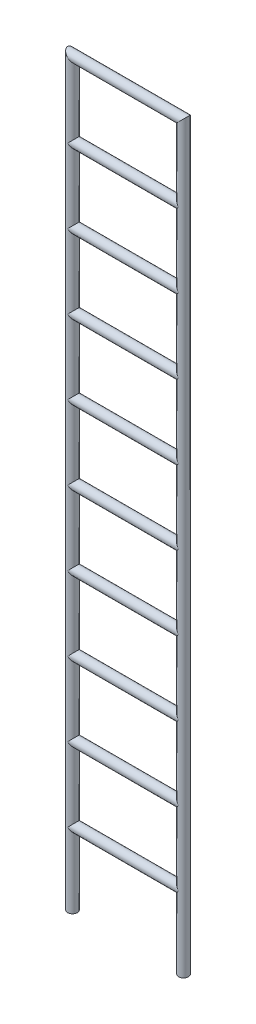
ISO-10303-21;
HEADER;
FILE_DESCRIPTION(('STEP AP214'),'2;1');
FILE_NAME('part.step','',(''),(''),'','','');
FILE_SCHEMA(('AUTOMOTIVE_DESIGN { 1 0 10303 214 1 1 1 1 }'));
ENDSEC;
DATA;
#1=APPLICATION_CONTEXT('core data for automotive mechanical design processes');
#2=APPLICATION_PROTOCOL_DEFINITION('international standard','automotive_design',2000,#1);
#3=PRODUCT_CONTEXT('',#1,'mechanical');
#4=PRODUCT('Part','Part','',(#3));
#5=PRODUCT_RELATED_PRODUCT_CATEGORY('part','',(#4));
#6=PRODUCT_DEFINITION_FORMATION('','',#4);
#7=PRODUCT_DEFINITION_CONTEXT('part definition',#1,'design');
#8=PRODUCT_DEFINITION('design','',#6,#7);
#9=PRODUCT_DEFINITION_SHAPE('','',#8);
#10=(LENGTH_UNIT() NAMED_UNIT(*) SI_UNIT(.MILLI.,.METRE.));
#11=(NAMED_UNIT(*) PLANE_ANGLE_UNIT() SI_UNIT($,.RADIAN.));
#12=(NAMED_UNIT(*) SI_UNIT($,.STERADIAN.) SOLID_ANGLE_UNIT());
#13=UNCERTAINTY_MEASURE_WITH_UNIT(LENGTH_MEASURE(1.E-05),#10,'distance_accuracy_value','');
#14=(GEOMETRIC_REPRESENTATION_CONTEXT(3) GLOBAL_UNCERTAINTY_ASSIGNED_CONTEXT((#13)) GLOBAL_UNIT_ASSIGNED_CONTEXT((#10,
#11,#12)) REPRESENTATION_CONTEXT('',''));
#15=CARTESIAN_POINT('',(0.,0.,0.));
#16=DIRECTION('',(0.,0.,1.));
#17=DIRECTION('',(1.,0.,0.));
#18=AXIS2_PLACEMENT_3D('',#15,#16,#17);
#19=CARTESIAN_POINT('',(-22.1,2743.2,0.));
#20=DIRECTION('',(1.,0.,0.));
#21=DIRECTION('',(0.,0.,-1.));
#22=AXIS2_PLACEMENT_3D('',#19,#20,#21);
#23=CYLINDRICAL_SURFACE('',#22,20.);
#24=CARTESIAN_POINT('',(-7.21644966006352E-13,2743.2,0.));
#25=DIRECTION('',(0.707106781186547,-0.707106781186547,0.));
#26=DIRECTION('',(0.707106781186547,0.707106781186547,0.));
#27=AXIS2_PLACEMENT_3D('',#24,#25,#26);
#28=ELLIPSE('',#27,28.2842712474619,20.);
#29=CARTESIAN_POINT('',(-2.91842067894383E-13,2743.2,20.));
#30=VERTEX_POINT('',#29);
#31=CARTESIAN_POINT('',(-7.21644966006352E-13,2743.2,-20.));
#32=VERTEX_POINT('',#31);
#33=EDGE_CURVE('E104',#30,#32,#28,.F.);
#34=ORIENTED_EDGE('',*,*,#33,.F.);
#35=CARTESIAN_POINT('',(-3.33066907387547E-13,2743.2,0.));
#36=DIRECTION('',(0.707106781186548,0.707106781186548,0.));
#37=DIRECTION('',(-0.707106781186548,0.707106781186548,0.));
#38=AXIS2_PLACEMENT_3D('',#35,#36,#37);
#39=ELLIPSE('',#38,28.2842712474619,20.);
#40=EDGE_CURVE('E215',#30,#32,#39,.T.);
#41=ORIENTED_EDGE('',*,*,#40,.T.);
#42=EDGE_LOOP('',(#34,#41));
#43=FACE_BOUND('',#42,.T.);
#44=CARTESIAN_POINT('',(457.2,2743.2,0.));
#45=DIRECTION('',(0.707106781186548,0.707106781186547,0.));
#46=DIRECTION('',(0.707106781186547,-0.707106781186548,0.));
#47=AXIS2_PLACEMENT_3D('',#44,#45,#46);
#48=ELLIPSE('',#47,28.2842712474619,20.);
#49=CARTESIAN_POINT('',(457.2,2743.2,-20.));
#50=VERTEX_POINT('',#49);
#51=CARTESIAN_POINT('',(457.2,2743.2,20.));
#52=VERTEX_POINT('',#51);
#53=EDGE_CURVE('E12',#50,#52,#48,.T.);
#54=ORIENTED_EDGE('',*,*,#53,.F.);
#55=CARTESIAN_POINT('',(457.2,2743.2,0.));
#56=DIRECTION('',(0.707106781186547,-0.707106781186548,0.));
#57=DIRECTION('',(0.707106781186548,0.707106781186547,0.));
#58=AXIS2_PLACEMENT_3D('',#55,#56,#57);
#59=ELLIPSE('',#58,28.2842712474619,20.);
#60=EDGE_CURVE('E218',#52,#50,#59,.T.);
#61=ORIENTED_EDGE('',*,*,#60,.F.);
#62=EDGE_LOOP('',(#54,#61));
#63=FACE_BOUND('',#62,.T.);
#64=ADVANCED_FACE('F96',(#43,#63),#23,.T.);
#65=CARTESIAN_POINT('',(-22.1,2438.4,0.));
#66=DIRECTION('',(1.,0.,0.));
#67=DIRECTION('',(0.,0.,-1.));
#68=AXIS2_PLACEMENT_3D('',#65,#66,#67);
#69=CYLINDRICAL_SURFACE('',#68,20.);
#70=CARTESIAN_POINT('',(-3.33066907387547E-13,2438.4,0.));
#71=DIRECTION('',(0.707106781186547,-0.707106781186547,0.));
#72=DIRECTION('',(0.707106781186547,0.707106781186547,0.));
#73=AXIS2_PLACEMENT_3D('',#70,#71,#72);
#74=ELLIPSE('',#73,28.2842712474619,20.);
#75=CARTESIAN_POINT('',(-1.11022302462516E-13,2438.4,20.));
#76=VERTEX_POINT('',#75);
#77=CARTESIAN_POINT('',(-3.33066907387547E-13,2438.4,-20.));
#78=VERTEX_POINT('',#77);
#79=EDGE_CURVE('E224',#76,#78,#74,.F.);
#80=ORIENTED_EDGE('',*,*,#79,.F.);
#81=CARTESIAN_POINT('',(1.11022302462516E-13,2438.4,0.));
#82=DIRECTION('',(0.707106781186548,0.707106781186548,0.));
#83=DIRECTION('',(-0.707106781186548,0.707106781186548,0.));
#84=AXIS2_PLACEMENT_3D('',#81,#82,#83);
#85=ELLIPSE('',#84,28.2842712474619,20.);
#86=EDGE_CURVE('E311',#76,#78,#85,.T.);
#87=ORIENTED_EDGE('',*,*,#86,.T.);
#88=EDGE_LOOP('',(#80,#87));
#89=FACE_BOUND('',#88,.T.);
#90=CARTESIAN_POINT('',(457.2,2438.4,0.));
#91=DIRECTION('',(0.707106781186548,0.707106781186547,0.));
#92=DIRECTION('',(0.707106781186547,-0.707106781186548,0.));
#93=AXIS2_PLACEMENT_3D('',#90,#91,#92);
#94=ELLIPSE('',#93,28.2842712474619,20.);
#95=CARTESIAN_POINT('',(457.2,2438.4,-20.));
#96=VERTEX_POINT('',#95);
#97=CARTESIAN_POINT('',(457.2,2438.4,20.));
#98=VERTEX_POINT('',#97);
#99=EDGE_CURVE('E222',#96,#98,#94,.T.);
#100=ORIENTED_EDGE('',*,*,#99,.F.);
#101=CARTESIAN_POINT('',(457.2,2438.4,0.));
#102=DIRECTION('',(0.707106781186547,-0.707106781186548,0.));
#103=DIRECTION('',(0.707106781186548,0.707106781186547,0.));
#104=AXIS2_PLACEMENT_3D('',#101,#102,#103);
#105=ELLIPSE('',#104,28.2842712474619,20.);
#106=EDGE_CURVE('E217',#98,#96,#105,.T.);
#107=ORIENTED_EDGE('',*,*,#106,.F.);
#108=EDGE_LOOP('',(#100,#107));
#109=FACE_BOUND('',#108,.T.);
#110=ADVANCED_FACE('F347',(#89,#109),#69,.T.);
#111=CARTESIAN_POINT('',(-22.1,2133.6,0.));
#112=DIRECTION('',(1.,0.,0.));
#113=DIRECTION('',(0.,0.,-1.));
#114=AXIS2_PLACEMENT_3D('',#111,#112,#113);
#115=CYLINDRICAL_SURFACE('',#114,20.);
#116=CARTESIAN_POINT('',(1.11022302462516E-13,2133.6,0.));
#117=DIRECTION('',(0.707106781186547,-0.707106781186547,0.));
#118=DIRECTION('',(0.707106781186547,0.707106781186547,0.));
#119=AXIS2_PLACEMENT_3D('',#116,#117,#118);
#120=ELLIPSE('',#119,28.2842712474619,20.);
#121=CARTESIAN_POINT('',(0.,2133.6,20.));
#122=VERTEX_POINT('',#121);
#123=CARTESIAN_POINT('',(-4.25040794199271E-13,2133.6,-20.));
#124=VERTEX_POINT('',#123);
#125=EDGE_CURVE('E232',#122,#124,#120,.F.);
#126=ORIENTED_EDGE('',*,*,#125,.F.);
#127=CARTESIAN_POINT('',(0.,2133.6,0.));
#128=DIRECTION('',(0.707106781186547,0.707106781186547,0.));
#129=DIRECTION('',(-0.707106781186548,0.707106781186548,0.));
#130=AXIS2_PLACEMENT_3D('',#127,#128,#129);
#131=ELLIPSE('',#130,28.2842712474619,20.);
#132=EDGE_CURVE('E306',#122,#124,#131,.T.);
#133=ORIENTED_EDGE('',*,*,#132,.T.);
#134=EDGE_LOOP('',(#126,#133));
#135=FACE_BOUND('',#134,.T.);
#136=CARTESIAN_POINT('',(457.2,2133.6,0.));
#137=DIRECTION('',(0.707106781186548,0.707106781186547,0.));
#138=DIRECTION('',(0.707106781186547,-0.707106781186548,0.));
#139=AXIS2_PLACEMENT_3D('',#136,#137,#138);
#140=ELLIPSE('',#139,28.2842712474619,20.);
#141=CARTESIAN_POINT('',(457.2,2133.6,-20.));
#142=VERTEX_POINT('',#141);
#143=CARTESIAN_POINT('',(457.200000000001,2133.6,20.));
#144=VERTEX_POINT('',#143);
#145=EDGE_CURVE('E229',#142,#144,#140,.T.);
#146=ORIENTED_EDGE('',*,*,#145,.F.);
#147=CARTESIAN_POINT('',(457.2,2133.6,0.));
#148=DIRECTION('',(0.707106781186547,-0.707106781186548,0.));
#149=DIRECTION('',(0.707106781186548,0.707106781186547,0.));
#150=AXIS2_PLACEMENT_3D('',#147,#148,#149);
#151=ELLIPSE('',#150,28.2842712474619,20.);
#152=EDGE_CURVE('E308',#144,#142,#151,.T.);
#153=ORIENTED_EDGE('',*,*,#152,.F.);
#154=EDGE_LOOP('',(#146,#153));
#155=FACE_BOUND('',#154,.T.);
#156=ADVANCED_FACE('F352',(#135,#155),#115,.T.);
#157=CARTESIAN_POINT('',(-22.1000000000002,1828.8,0.));
#158=DIRECTION('',(1.,0.,0.));
#159=DIRECTION('',(0.,0.,-1.));
#160=AXIS2_PLACEMENT_3D('',#157,#158,#159);
#161=CYLINDRICAL_SURFACE('',#160,20.);
#162=CARTESIAN_POINT('',(0.,1828.8,0.));
#163=DIRECTION('',(0.707106781186547,-0.707106781186547,0.));
#164=DIRECTION('',(0.707106781186547,0.707106781186547,0.));
#165=AXIS2_PLACEMENT_3D('',#162,#163,#164);
#166=ELLIPSE('',#165,28.2842712474619,20.);
#167=CARTESIAN_POINT('',(-1.66533453693774E-13,1828.8,20.));
#168=VERTEX_POINT('',#167);
#169=CARTESIAN_POINT('',(0.,1828.8,-20.));
#170=VERTEX_POINT('',#169);
#171=EDGE_CURVE('E238',#168,#170,#166,.F.);
#172=ORIENTED_EDGE('',*,*,#171,.F.);
#173=CARTESIAN_POINT('',(-3.88578058618805E-13,1828.8,0.));
#174=DIRECTION('',(0.707106781186547,0.707106781186547,0.));
#175=DIRECTION('',(-0.707106781186548,0.707106781186548,0.));
#176=AXIS2_PLACEMENT_3D('',#173,#174,#175);
#177=ELLIPSE('',#176,28.2842712474619,20.);
#178=EDGE_CURVE('E301',#168,#170,#177,.T.);
#179=ORIENTED_EDGE('',*,*,#178,.T.);
#180=EDGE_LOOP('',(#172,#179));
#181=FACE_BOUND('',#180,.T.);
#182=CARTESIAN_POINT('',(457.2,1828.8,0.));
#183=DIRECTION('',(0.707106781186548,0.707106781186547,0.));
#184=DIRECTION('',(0.707106781186547,-0.707106781186548,0.));
#185=AXIS2_PLACEMENT_3D('',#182,#183,#184);
#186=ELLIPSE('',#185,28.2842712474619,20.);
#187=CARTESIAN_POINT('',(457.2,1828.8,-20.));
#188=VERTEX_POINT('',#187);
#189=CARTESIAN_POINT('',(457.2,1828.8,20.));
#190=VERTEX_POINT('',#189);
#191=EDGE_CURVE('E235',#188,#190,#186,.T.);
#192=ORIENTED_EDGE('',*,*,#191,.F.);
#193=CARTESIAN_POINT('',(457.2,1828.8,0.));
#194=DIRECTION('',(0.707106781186547,-0.707106781186548,0.));
#195=DIRECTION('',(0.707106781186548,0.707106781186547,0.));
#196=AXIS2_PLACEMENT_3D('',#193,#194,#195);
#197=ELLIPSE('',#196,28.2842712474619,20.);
#198=EDGE_CURVE('E303',#190,#188,#197,.T.);
#199=ORIENTED_EDGE('',*,*,#198,.F.);
#200=EDGE_LOOP('',(#192,#199));
#201=FACE_BOUND('',#200,.T.);
#202=ADVANCED_FACE('F358',(#181,#201),#161,.T.);
#203=CARTESIAN_POINT('',(-22.1,1524.,0.));
#204=DIRECTION('',(1.,0.,0.));
#205=DIRECTION('',(0.,0.,-1.));
#206=AXIS2_PLACEMENT_3D('',#203,#204,#205);
#207=CYLINDRICAL_SURFACE('',#206,20.);
#208=CARTESIAN_POINT('',(-3.88578058618805E-13,1524.,0.));
#209=DIRECTION('',(0.707106781186547,-0.707106781186547,0.));
#210=DIRECTION('',(0.707106781186547,0.707106781186547,0.));
#211=AXIS2_PLACEMENT_3D('',#208,#209,#210);
#212=ELLIPSE('',#211,28.2842712474619,20.);
#213=CARTESIAN_POINT('',(-1.48302085903541E-13,1524.,20.));
#214=VERTEX_POINT('',#213);
#215=CARTESIAN_POINT('',(-7.67631909412214E-13,1524.,-20.));
#216=VERTEX_POINT('',#215);
#217=EDGE_CURVE('E244',#214,#216,#212,.F.);
#218=ORIENTED_EDGE('',*,*,#217,.F.);
#219=CARTESIAN_POINT('',(-2.22044604925031E-13,1524.,0.));
#220=DIRECTION('',(0.707106781186547,0.707106781186547,0.));
#221=DIRECTION('',(-0.707106781186548,0.707106781186548,0.));
#222=AXIS2_PLACEMENT_3D('',#219,#220,#221);
#223=ELLIPSE('',#222,28.2842712474619,20.);
#224=EDGE_CURVE('E296',#214,#216,#223,.T.);
#225=ORIENTED_EDGE('',*,*,#224,.T.);
#226=EDGE_LOOP('',(#218,#225));
#227=FACE_BOUND('',#226,.T.);
#228=CARTESIAN_POINT('',(457.2,1524.,0.));
#229=DIRECTION('',(0.707106781186548,0.707106781186547,0.));
#230=DIRECTION('',(0.707106781186547,-0.707106781186548,0.));
#231=AXIS2_PLACEMENT_3D('',#228,#229,#230);
#232=ELLIPSE('',#231,28.2842712474619,20.);
#233=CARTESIAN_POINT('',(457.2,1524.,-20.));
#234=VERTEX_POINT('',#233);
#235=CARTESIAN_POINT('',(457.2,1524.,20.));
#236=VERTEX_POINT('',#235);
#237=EDGE_CURVE('E241',#234,#236,#232,.T.);
#238=ORIENTED_EDGE('',*,*,#237,.F.);
#239=CARTESIAN_POINT('',(457.2,1524.,0.));
#240=DIRECTION('',(0.707106781186547,-0.707106781186548,0.));
#241=DIRECTION('',(0.707106781186548,0.707106781186547,0.));
#242=AXIS2_PLACEMENT_3D('',#239,#240,#241);
#243=ELLIPSE('',#242,28.2842712474619,20.);
#244=EDGE_CURVE('E298',#236,#234,#243,.T.);
#245=ORIENTED_EDGE('',*,*,#244,.F.);
#246=EDGE_LOOP('',(#238,#245));
#247=FACE_BOUND('',#246,.T.);
#248=ADVANCED_FACE('F362',(#227,#247),#207,.T.);
#249=CARTESIAN_POINT('',(-22.1,1219.2,0.));
#250=DIRECTION('',(1.,0.,0.));
#251=DIRECTION('',(0.,0.,-1.));
#252=AXIS2_PLACEMENT_3D('',#249,#250,#251);
#253=CYLINDRICAL_SURFACE('',#252,20.);
#254=CARTESIAN_POINT('',(-2.22044604925031E-13,1219.2,0.));
#255=DIRECTION('',(0.707106781186547,-0.707106781186547,0.));
#256=DIRECTION('',(0.707106781186547,0.707106781186547,0.));
#257=AXIS2_PLACEMENT_3D('',#254,#255,#256);
#258=ELLIPSE('',#257,28.2842712474619,20.);
#259=CARTESIAN_POINT('',(0.,1219.2,20.));
#260=VERTEX_POINT('',#259);
#261=CARTESIAN_POINT('',(-6.79603078652629E-13,1219.2,-20.));
#262=VERTEX_POINT('',#261);
#263=EDGE_CURVE('E250',#260,#262,#258,.F.);
#264=ORIENTED_EDGE('',*,*,#263,.F.);
#265=CARTESIAN_POINT('',(-1.11022302462516E-13,1219.2,0.));
#266=DIRECTION('',(0.707106781186548,0.707106781186548,0.));
#267=DIRECTION('',(-0.707106781186548,0.707106781186548,0.));
#268=AXIS2_PLACEMENT_3D('',#265,#266,#267);
#269=ELLIPSE('',#268,28.2842712474619,20.);
#270=EDGE_CURVE('E291',#260,#262,#269,.T.);
#271=ORIENTED_EDGE('',*,*,#270,.T.);
#272=EDGE_LOOP('',(#264,#271));
#273=FACE_BOUND('',#272,.T.);
#274=CARTESIAN_POINT('',(457.2,1219.2,0.));
#275=DIRECTION('',(0.707106781186548,0.707106781186547,0.));
#276=DIRECTION('',(0.707106781186547,-0.707106781186548,0.));
#277=AXIS2_PLACEMENT_3D('',#274,#275,#276);
#278=ELLIPSE('',#277,28.2842712474619,20.);
#279=CARTESIAN_POINT('',(457.2,1219.2,-20.));
#280=VERTEX_POINT('',#279);
#281=CARTESIAN_POINT('',(457.2,1219.2,20.));
#282=VERTEX_POINT('',#281);
#283=EDGE_CURVE('E247',#280,#282,#278,.T.);
#284=ORIENTED_EDGE('',*,*,#283,.F.);
#285=CARTESIAN_POINT('',(457.2,1219.2,0.));
#286=DIRECTION('',(0.707106781186547,-0.707106781186548,0.));
#287=DIRECTION('',(0.707106781186548,0.707106781186547,0.));
#288=AXIS2_PLACEMENT_3D('',#285,#286,#287);
#289=ELLIPSE('',#288,28.2842712474619,20.);
#290=EDGE_CURVE('E293',#282,#280,#289,.T.);
#291=ORIENTED_EDGE('',*,*,#290,.F.);
#292=EDGE_LOOP('',(#284,#291));
#293=FACE_BOUND('',#292,.T.);
#294=ADVANCED_FACE('F366',(#273,#293),#253,.T.);
#295=CARTESIAN_POINT('',(-22.1,914.4,0.));
#296=DIRECTION('',(1.,0.,0.));
#297=DIRECTION('',(0.,0.,-1.));
#298=AXIS2_PLACEMENT_3D('',#295,#296,#297);
#299=CYLINDRICAL_SURFACE('',#298,20.);
#300=CARTESIAN_POINT('',(-1.11022302462516E-13,914.4,0.));
#301=DIRECTION('',(0.707106781186547,-0.707106781186547,0.));
#302=DIRECTION('',(0.707106781186547,0.707106781186547,0.));
#303=AXIS2_PLACEMENT_3D('',#300,#301,#302);
#304=ELLIPSE('',#303,28.2842712474619,20.);
#305=CARTESIAN_POINT('',(0.,914.4,20.));
#306=VERTEX_POINT('',#305);
#307=CARTESIAN_POINT('',(-5.68580776190114E-13,914.4,-20.));
#308=VERTEX_POINT('',#307);
#309=EDGE_CURVE('E256',#306,#308,#304,.F.);
#310=ORIENTED_EDGE('',*,*,#309,.F.);
#311=CARTESIAN_POINT('',(-1.66533453693773E-13,914.4,0.));
#312=DIRECTION('',(0.707106781186548,0.707106781186548,0.));
#313=DIRECTION('',(-0.707106781186548,0.707106781186548,0.));
#314=AXIS2_PLACEMENT_3D('',#311,#312,#313);
#315=ELLIPSE('',#314,28.2842712474619,20.);
#316=EDGE_CURVE('E286',#306,#308,#315,.T.);
#317=ORIENTED_EDGE('',*,*,#316,.T.);
#318=EDGE_LOOP('',(#310,#317));
#319=FACE_BOUND('',#318,.T.);
#320=CARTESIAN_POINT('',(457.2,914.4,0.));
#321=DIRECTION('',(0.707106781186548,0.707106781186547,0.));
#322=DIRECTION('',(0.707106781186547,-0.707106781186548,0.));
#323=AXIS2_PLACEMENT_3D('',#320,#321,#322);
#324=ELLIPSE('',#323,28.2842712474619,20.);
#325=CARTESIAN_POINT('',(457.2,914.4,-20.));
#326=VERTEX_POINT('',#325);
#327=CARTESIAN_POINT('',(457.2,914.4,20.));
#328=VERTEX_POINT('',#327);
#329=EDGE_CURVE('E253',#326,#328,#324,.T.);
#330=ORIENTED_EDGE('',*,*,#329,.F.);
#331=CARTESIAN_POINT('',(457.2,914.4,0.));
#332=DIRECTION('',(0.707106781186547,-0.707106781186548,0.));
#333=DIRECTION('',(0.707106781186548,0.707106781186547,0.));
#334=AXIS2_PLACEMENT_3D('',#331,#332,#333);
#335=ELLIPSE('',#334,28.2842712474619,20.);
#336=EDGE_CURVE('E288',#328,#326,#335,.T.);
#337=ORIENTED_EDGE('',*,*,#336,.F.);
#338=EDGE_LOOP('',(#330,#337));
#339=FACE_BOUND('',#338,.T.);
#340=ADVANCED_FACE('F370',(#319,#339),#299,.T.);
#341=CARTESIAN_POINT('',(-22.1,609.6,0.));
#342=DIRECTION('',(1.,0.,0.));
#343=DIRECTION('',(0.,0.,-1.));
#344=AXIS2_PLACEMENT_3D('',#341,#342,#343);
#345=CYLINDRICAL_SURFACE('',#344,20.);
#346=CARTESIAN_POINT('',(-1.64798730217797E-13,609.6,0.));
#347=DIRECTION('',(0.707106781186548,-0.707106781186547,0.));
#348=DIRECTION('',(0.707106781186548,0.707106781186547,0.));
#349=AXIS2_PLACEMENT_3D('',#346,#347,#348);
#350=ELLIPSE('',#349,28.2842712474619,20.);
#351=CARTESIAN_POINT('',(-1.10154940724527E-13,609.6,20.));
#352=VERTEX_POINT('',#351);
#353=CARTESIAN_POINT('',(-2.99681866121232E-13,609.6,-20.));
#354=VERTEX_POINT('',#353);
#355=EDGE_CURVE('E262',#352,#354,#350,.F.);
#356=ORIENTED_EDGE('',*,*,#355,.F.);
#357=CARTESIAN_POINT('',(0.,609.6,0.));
#358=DIRECTION('',(0.707106781186547,0.707106781186547,0.));
#359=DIRECTION('',(-0.707106781186548,0.707106781186548,0.));
#360=AXIS2_PLACEMENT_3D('',#357,#358,#359);
#361=ELLIPSE('',#360,28.2842712474619,20.);
#362=EDGE_CURVE('E276',#352,#354,#361,.T.);
#363=ORIENTED_EDGE('',*,*,#362,.T.);
#364=EDGE_LOOP('',(#356,#363));
#365=FACE_BOUND('',#364,.T.);
#366=CARTESIAN_POINT('',(457.2,609.6,0.));
#367=DIRECTION('',(0.707106781186548,0.707106781186547,0.));
#368=DIRECTION('',(0.707106781186547,-0.707106781186548,0.));
#369=AXIS2_PLACEMENT_3D('',#366,#367,#368);
#370=ELLIPSE('',#369,28.2842712474619,20.);
#371=CARTESIAN_POINT('',(457.2,609.6,-20.));
#372=VERTEX_POINT('',#371);
#373=CARTESIAN_POINT('',(457.2,609.6,20.));
#374=VERTEX_POINT('',#373);
#375=EDGE_CURVE('E259',#372,#374,#370,.T.);
#376=ORIENTED_EDGE('',*,*,#375,.F.);
#377=CARTESIAN_POINT('',(457.2,609.6,0.));
#378=DIRECTION('',(0.707106781186547,-0.707106781186548,0.));
#379=DIRECTION('',(0.707106781186548,0.707106781186547,0.));
#380=AXIS2_PLACEMENT_3D('',#377,#378,#379);
#381=ELLIPSE('',#380,28.2842712474619,20.);
#382=EDGE_CURVE('E283',#374,#372,#381,.T.);
#383=ORIENTED_EDGE('',*,*,#382,.F.);
#384=EDGE_LOOP('',(#376,#383));
#385=FACE_BOUND('',#384,.T.);
#386=ADVANCED_FACE('F344',(#365,#385),#345,.T.);
#387=CARTESIAN_POINT('',(-22.1,304.8,0.));
#388=DIRECTION('',(1.,0.,0.));
#389=DIRECTION('',(0.,0.,-1.));
#390=AXIS2_PLACEMENT_3D('',#387,#388,#389);
#391=CYLINDRICAL_SURFACE('',#390,20.);
#392=CARTESIAN_POINT('',(0.,304.8,0.));
#393=DIRECTION('',(0.707106781186547,-0.707106781186547,0.));
#394=DIRECTION('',(0.707106781186547,0.707106781186547,0.));
#395=AXIS2_PLACEMENT_3D('',#392,#393,#394);
#396=ELLIPSE('',#395,28.2842712474619,20.);
#397=CARTESIAN_POINT('',(1.17756934401283E-13,304.8,20.));
#398=VERTEX_POINT('',#397);
#399=CARTESIAN_POINT('',(1.17756934401283E-13,304.8,-20.));
#400=VERTEX_POINT('',#399);
#401=EDGE_CURVE('E268',#398,#400,#396,.F.);
#402=ORIENTED_EDGE('',*,*,#401,.F.);
#403=CARTESIAN_POINT('',(-1.11022302462516E-13,304.8,0.));
#404=DIRECTION('',(0.707106781186548,0.707106781186548,0.));
#405=DIRECTION('',(-0.707106781186548,0.707106781186548,0.));
#406=AXIS2_PLACEMENT_3D('',#403,#404,#405);
#407=ELLIPSE('',#406,28.2842712474619,20.);
#408=EDGE_CURVE('E271',#398,#400,#407,.T.);
#409=ORIENTED_EDGE('',*,*,#408,.T.);
#410=EDGE_LOOP('',(#402,#409));
#411=FACE_BOUND('',#410,.T.);
#412=CARTESIAN_POINT('',(457.2,304.8,0.));
#413=DIRECTION('',(0.707106781186548,0.707106781186547,0.));
#414=DIRECTION('',(0.707106781186547,-0.707106781186548,0.));
#415=AXIS2_PLACEMENT_3D('',#412,#413,#414);
#416=ELLIPSE('',#415,28.2842712474619,20.);
#417=CARTESIAN_POINT('',(457.2,304.8,-20.));
#418=VERTEX_POINT('',#417);
#419=CARTESIAN_POINT('',(457.2,304.8,20.));
#420=VERTEX_POINT('',#419);
#421=EDGE_CURVE('E265',#418,#420,#416,.T.);
#422=ORIENTED_EDGE('',*,*,#421,.F.);
#423=CARTESIAN_POINT('',(457.2,304.8,0.));
#424=DIRECTION('',(0.707106781186547,-0.707106781186548,0.));
#425=DIRECTION('',(0.707106781186548,0.707106781186547,0.));
#426=AXIS2_PLACEMENT_3D('',#423,#424,#425);
#427=ELLIPSE('',#426,28.2842712474619,20.);
#428=EDGE_CURVE('E275',#420,#418,#427,.T.);
#429=ORIENTED_EDGE('',*,*,#428,.F.);
#430=EDGE_LOOP('',(#422,#429));
#431=FACE_BOUND('',#430,.T.);
#432=ADVANCED_FACE('F330',(#411,#431),#391,.T.);
#433=CARTESIAN_POINT('',(457.2,0.,0.));
#434=DIRECTION('',(0.,1.,0.));
#435=DIRECTION('',(-1.,0.,0.));
#436=AXIS2_PLACEMENT_3D('',#433,#434,#435);
#437=PLANE('',#436);
#438=CARTESIAN_POINT('',(457.2,0.,0.));
#439=DIRECTION('',(0.,1.,0.));
#440=DIRECTION('',(-1.,0.,0.));
#441=AXIS2_PLACEMENT_3D('',#438,#439,#440);
#442=CIRCLE('',#441,20.);
#443=CARTESIAN_POINT('',(437.2,0.,0.));
#444=VERTEX_POINT('',#443);
#445=EDGE_CURVE('E272',#444,#444,#442,.T.);
#446=ORIENTED_EDGE('',*,*,#445,.F.);
#447=EDGE_LOOP('',(#446));
#448=FACE_BOUND('',#447,.T.);
#449=ADVANCED_FACE('F98',(#448),#437,.F.);
#450=CARTESIAN_POINT('',(-1.11022302462516E-13,0.,0.));
#451=DIRECTION('',(0.,-1.,0.));
#452=DIRECTION('',(1.,0.,0.));
#453=AXIS2_PLACEMENT_3D('',#450,#451,#452);
#454=PLANE('',#453);
#455=CARTESIAN_POINT('',(-1.11022302462516E-13,0.,0.));
#456=DIRECTION('',(0.,-1.,0.));
#457=DIRECTION('',(1.,0.,0.));
#458=AXIS2_PLACEMENT_3D('',#455,#456,#457);
#459=CIRCLE('',#458,20.);
#460=CARTESIAN_POINT('',(19.9999999999999,0.,0.));
#461=VERTEX_POINT('',#460);
#462=EDGE_CURVE('E279',#461,#461,#459,.T.);
#463=ORIENTED_EDGE('',*,*,#462,.T.);
#464=EDGE_LOOP('',(#463));
#465=FACE_BOUND('',#464,.T.);
#466=ADVANCED_FACE('F336',(#465),#454,.T.);
#467=CARTESIAN_POINT('',(457.2,326.9,0.));
#468=DIRECTION('',(0.,-1.,0.));
#469=DIRECTION('',(1.,0.,0.));
#470=AXIS2_PLACEMENT_3D('',#467,#468,#469);
#471=CYLINDRICAL_SURFACE('',#470,20.);
#472=ORIENTED_EDGE('',*,*,#53,.T.);
#473=ORIENTED_EDGE('',*,*,#60,.T.);
#474=EDGE_LOOP('',(#472,#473));
#475=FACE_BOUND('',#474,.T.);
#476=CARTESIAN_POINT('',(457.200000000001,3048.,0.));
#477=DIRECTION('',(0.707106781186547,-0.707106781186548,0.));
#478=DIRECTION('',(0.707106781186548,0.707106781186547,0.));
#479=AXIS2_PLACEMENT_3D('',#476,#477,#478);
#480=ELLIPSE('',#479,28.2842712474619,20.);
#481=CARTESIAN_POINT('',(477.200000000001,3068.,0.));
#482=VERTEX_POINT('',#481);
#483=EDGE_CURVE('E318',#482,#482,#480,.T.);
#484=ORIENTED_EDGE('',*,*,#483,.T.);
#485=EDGE_LOOP('',(#484));
#486=FACE_BOUND('',#485,.T.);
#487=ORIENTED_EDGE('',*,*,#145,.T.);
#488=ORIENTED_EDGE('',*,*,#152,.T.);
#489=EDGE_LOOP('',(#487,#488));
#490=FACE_BOUND('',#489,.T.);
#491=ORIENTED_EDGE('',*,*,#237,.T.);
#492=ORIENTED_EDGE('',*,*,#244,.T.);
#493=EDGE_LOOP('',(#491,#492));
#494=FACE_BOUND('',#493,.T.);
#495=ORIENTED_EDGE('',*,*,#329,.T.);
#496=ORIENTED_EDGE('',*,*,#336,.T.);
#497=EDGE_LOOP('',(#495,#496));
#498=FACE_BOUND('',#497,.T.);
#499=ORIENTED_EDGE('',*,*,#421,.T.);
#500=ORIENTED_EDGE('',*,*,#428,.T.);
#501=EDGE_LOOP('',(#499,#500));
#502=FACE_BOUND('',#501,.T.);
#503=ORIENTED_EDGE('',*,*,#445,.T.);
#504=EDGE_LOOP('',(#503));
#505=FACE_BOUND('',#504,.T.);
#506=ORIENTED_EDGE('',*,*,#375,.T.);
#507=ORIENTED_EDGE('',*,*,#382,.T.);
#508=EDGE_LOOP('',(#506,#507));
#509=FACE_BOUND('',#508,.T.);
#510=ORIENTED_EDGE('',*,*,#283,.T.);
#511=ORIENTED_EDGE('',*,*,#290,.T.);
#512=EDGE_LOOP('',(#510,#511));
#513=FACE_BOUND('',#512,.T.);
#514=ORIENTED_EDGE('',*,*,#191,.T.);
#515=ORIENTED_EDGE('',*,*,#198,.T.);
#516=EDGE_LOOP('',(#514,#515));
#517=FACE_BOUND('',#516,.T.);
#518=ORIENTED_EDGE('',*,*,#99,.T.);
#519=ORIENTED_EDGE('',*,*,#106,.T.);
#520=EDGE_LOOP('',(#518,#519));
#521=FACE_BOUND('',#520,.T.);
#522=ADVANCED_FACE('F327',(#475,#486,#490,#494,#498,#502,#505,#509,#513,#517,#521),#471,.T.);
#523=CARTESIAN_POINT('',(-1.11022302462516E-13,0.,0.));
#524=DIRECTION('',(0.,1.,0.));
#525=DIRECTION('',(0.,0.,1.));
#526=AXIS2_PLACEMENT_3D('',#523,#524,#525);
#527=CYLINDRICAL_SURFACE('',#526,20.);
#528=ORIENTED_EDGE('',*,*,#462,.F.);
#529=EDGE_LOOP('',(#528));
#530=FACE_BOUND('',#529,.T.);
#531=ORIENTED_EDGE('',*,*,#408,.F.);
#532=ORIENTED_EDGE('',*,*,#401,.T.);
#533=EDGE_LOOP('',(#531,#532));
#534=FACE_BOUND('',#533,.T.);
#535=ORIENTED_EDGE('',*,*,#362,.F.);
#536=ORIENTED_EDGE('',*,*,#355,.T.);
#537=EDGE_LOOP('',(#535,#536));
#538=FACE_BOUND('',#537,.T.);
#539=ORIENTED_EDGE('',*,*,#316,.F.);
#540=ORIENTED_EDGE('',*,*,#309,.T.);
#541=EDGE_LOOP('',(#539,#540));
#542=FACE_BOUND('',#541,.T.);
#543=ORIENTED_EDGE('',*,*,#270,.F.);
#544=ORIENTED_EDGE('',*,*,#263,.T.);
#545=EDGE_LOOP('',(#543,#544));
#546=FACE_BOUND('',#545,.T.);
#547=ORIENTED_EDGE('',*,*,#224,.F.);
#548=ORIENTED_EDGE('',*,*,#217,.T.);
#549=EDGE_LOOP('',(#547,#548));
#550=FACE_BOUND('',#549,.T.);
#551=ORIENTED_EDGE('',*,*,#178,.F.);
#552=ORIENTED_EDGE('',*,*,#171,.T.);
#553=EDGE_LOOP('',(#551,#552));
#554=FACE_BOUND('',#553,.T.);
#555=ORIENTED_EDGE('',*,*,#132,.F.);
#556=ORIENTED_EDGE('',*,*,#125,.T.);
#557=EDGE_LOOP('',(#555,#556));
#558=FACE_BOUND('',#557,.T.);
#559=ORIENTED_EDGE('',*,*,#86,.F.);
#560=ORIENTED_EDGE('',*,*,#79,.T.);
#561=EDGE_LOOP('',(#559,#560));
#562=FACE_BOUND('',#561,.T.);
#563=ORIENTED_EDGE('',*,*,#40,.F.);
#564=ORIENTED_EDGE('',*,*,#33,.T.);
#565=EDGE_LOOP('',(#563,#564));
#566=FACE_BOUND('',#565,.T.);
#567=CARTESIAN_POINT('',(-7.21644966006352E-13,3048.,0.));
#568=DIRECTION('',(0.707106781186548,0.707106781186548,0.));
#569=DIRECTION('',(-0.707106781186548,0.707106781186548,0.));
#570=AXIS2_PLACEMENT_3D('',#567,#568,#569);
#571=ELLIPSE('',#570,28.2842712474619,20.);
#572=CARTESIAN_POINT('',(-20.0000000000007,3068.,0.));
#573=VERTEX_POINT('',#572);
#574=EDGE_CURVE('E316',#573,#573,#571,.T.);
#575=ORIENTED_EDGE('',*,*,#574,.F.);
#576=EDGE_LOOP('',(#575));
#577=FACE_BOUND('',#576,.T.);
#578=ADVANCED_FACE('F220',(#530,#534,#538,#542,#546,#550,#554,#558,#562,#566,#577),#527,.T.);
#579=CARTESIAN_POINT('',(-22.1000000000005,3048.,0.));
#580=DIRECTION('',(1.,0.,0.));
#581=DIRECTION('',(0.,0.,-1.));
#582=AXIS2_PLACEMENT_3D('',#579,#580,#581);
#583=CYLINDRICAL_SURFACE('',#582,20.);
#584=ORIENTED_EDGE('',*,*,#574,.T.);
#585=EDGE_LOOP('',(#584));
#586=FACE_BOUND('',#585,.T.);
#587=ORIENTED_EDGE('',*,*,#483,.F.);
#588=EDGE_LOOP('',(#587));
#589=FACE_BOUND('',#588,.T.);
#590=ADVANCED_FACE('F324',(#586,#589),#583,.T.);
#591=CLOSED_SHELL('',(#64,#110,#156,#202,#248,#294,#340,#386,#432,#449,#466,#522,#578,#590));
#592=MANIFOLD_SOLID_BREP('B2',#591);
#593=ADVANCED_BREP_SHAPE_REPRESENTATION('',(#18,#592),#14);
#594=SHAPE_DEFINITION_REPRESENTATION(#9,#593);
ENDSEC;
END-ISO-10303-21;
